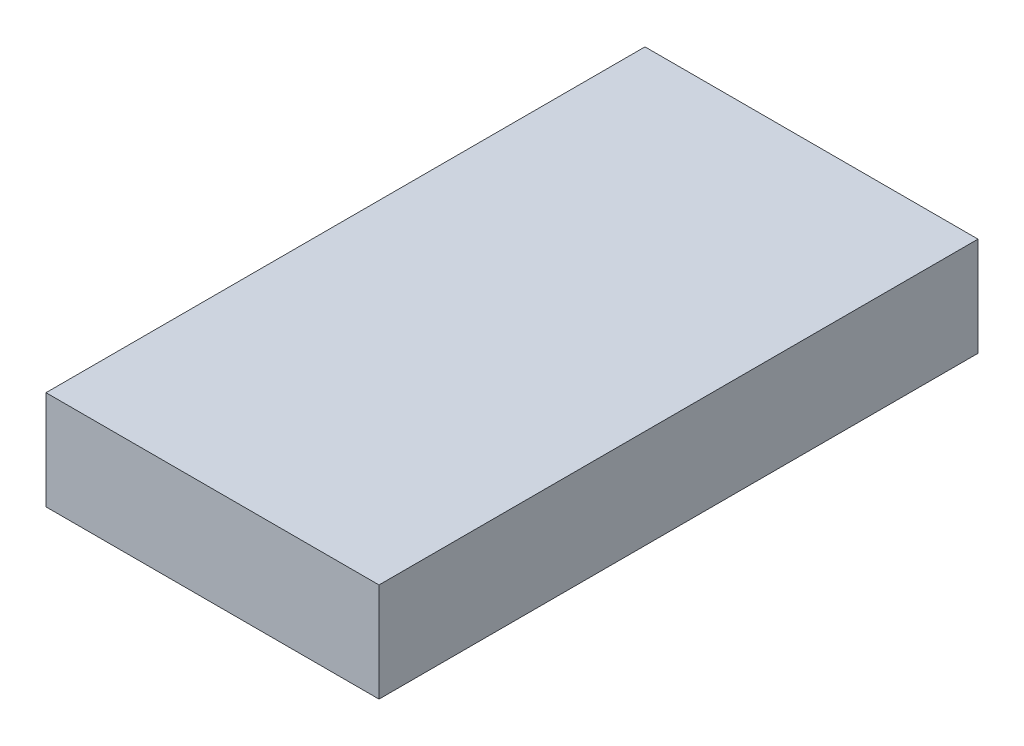
ISO-10303-21;
HEADER;
FILE_DESCRIPTION(('STEP AP214'),'2;1');
FILE_NAME('part.step','',(''),(''),'','','');
FILE_SCHEMA(('AUTOMOTIVE_DESIGN { 1 0 10303 214 1 1 1 1 }'));
ENDSEC;
DATA;
#1=APPLICATION_CONTEXT('core data for automotive mechanical design processes');
#2=APPLICATION_PROTOCOL_DEFINITION('international standard','automotive_design',2000,#1);
#3=PRODUCT_CONTEXT('',#1,'mechanical');
#4=PRODUCT('Part','Part','',(#3));
#5=PRODUCT_RELATED_PRODUCT_CATEGORY('part','',(#4));
#6=PRODUCT_DEFINITION_FORMATION('','',#4);
#7=PRODUCT_DEFINITION_CONTEXT('part definition',#1,'design');
#8=PRODUCT_DEFINITION('design','',#6,#7);
#9=PRODUCT_DEFINITION_SHAPE('','',#8);
#10=(LENGTH_UNIT() NAMED_UNIT(*) SI_UNIT(.MILLI.,.METRE.));
#11=(NAMED_UNIT(*) PLANE_ANGLE_UNIT() SI_UNIT($,.RADIAN.));
#12=(NAMED_UNIT(*) SI_UNIT($,.STERADIAN.) SOLID_ANGLE_UNIT());
#13=UNCERTAINTY_MEASURE_WITH_UNIT(LENGTH_MEASURE(1.E-05),#10,'distance_accuracy_value','');
#14=(GEOMETRIC_REPRESENTATION_CONTEXT(3) GLOBAL_UNCERTAINTY_ASSIGNED_CONTEXT((#13)) GLOBAL_UNIT_ASSIGNED_CONTEXT((#10,
#11,#12)) REPRESENTATION_CONTEXT('',''));
#15=CARTESIAN_POINT('',(0.,0.,0.));
#16=DIRECTION('',(0.,0.,1.));
#17=DIRECTION('',(1.,0.,0.));
#18=AXIS2_PLACEMENT_3D('',#15,#16,#17);
#19=CARTESIAN_POINT('',(0.,0.,0.));
#20=DIRECTION('',(0.,-1.,0.));
#21=DIRECTION('',(0.,0.,-1.));
#22=AXIS2_PLACEMENT_3D('',#19,#20,#21);
#23=PLANE('',#22);
#24=DIRECTION('',(1.,0.,0.));
#25=VECTOR('',#24,1.);
#26=CARTESIAN_POINT('',(25.3849687622807,0.,-25.1890079802592));
#27=LINE('',#26,#25);
#28=CARTESIAN_POINT('',(0.684968762280747,0.,-25.1890079802592));
#29=VERTEX_POINT('',#28);
#30=CARTESIAN_POINT('',(2.75540040668321,0.,-25.1890079802592));
#31=VERTEX_POINT('',#30);
#32=EDGE_CURVE('E55',#29,#31,#27,.T.);
#33=ORIENTED_EDGE('',*,*,#32,.F.);
#34=DIRECTION('',(0.,0.,-1.));
#35=VECTOR('',#34,1.);
#36=CARTESIAN_POINT('',(0.684968762280747,0.,0.0281061356304235));
#37=LINE('',#36,#35);
#38=CARTESIAN_POINT('',(0.684968762280747,0.,0.));
#39=VERTEX_POINT('',#38);
#40=EDGE_CURVE('E250',#39,#29,#37,.T.);
#41=ORIENTED_EDGE('',*,*,#40,.F.);
#42=DIRECTION('',(1.,0.,0.));
#43=VECTOR('',#42,1.);
#44=CARTESIAN_POINT('',(0.,0.,0.));
#45=LINE('',#44,#43);
#46=CARTESIAN_POINT('',(0.,0.,0.));
#47=VERTEX_POINT('',#46);
#48=EDGE_CURVE('E456',#47,#39,#45,.T.);
#49=ORIENTED_EDGE('',*,*,#48,.F.);
#50=DIRECTION('',(0.,0.,1.));
#51=VECTOR('',#50,1.);
#52=CARTESIAN_POINT('',(0.,0.,0.));
#53=LINE('',#52,#51);
#54=CARTESIAN_POINT('',(0.,0.,-46.));
#55=VERTEX_POINT('',#54);
#56=EDGE_CURVE('E430',#55,#47,#53,.T.);
#57=ORIENTED_EDGE('',*,*,#56,.F.);
#58=DIRECTION('',(-1.,0.,0.));
#59=VECTOR('',#58,1.);
#60=CARTESIAN_POINT('',(0.,0.,-46.));
#61=LINE('',#60,#59);
#62=CARTESIAN_POINT('',(2.75540040668321,0.,-46.));
#63=VERTEX_POINT('',#62);
#64=EDGE_CURVE('E463',#63,#55,#61,.T.);
#65=ORIENTED_EDGE('',*,*,#64,.F.);
#66=DIRECTION('',(0.,0.,-1.));
#67=VECTOR('',#66,1.);
#68=CARTESIAN_POINT('',(2.75540040668321,0.,0.));
#69=LINE('',#68,#67);
#70=EDGE_CURVE('E275',#31,#63,#69,.T.);
#71=ORIENTED_EDGE('',*,*,#70,.F.);
#72=EDGE_LOOP('',(#33,#41,#49,#57,#65,#71));
#73=FACE_BOUND('',#72,.T.);
#74=ADVANCED_FACE('F39',(#73),#23,.T.);
#75=CARTESIAN_POINT('',(0.,0.399999999999999,0.));
#76=DIRECTION('',(0.,1.,0.));
#77=DIRECTION('',(0.,0.,1.));
#78=AXIS2_PLACEMENT_3D('',#75,#76,#77);
#79=PLANE('',#78);
#80=DIRECTION('',(-1.,0.,0.));
#81=VECTOR('',#80,1.);
#82=CARTESIAN_POINT('',(0.,0.399999999999999,-25.1890079802592));
#83=LINE('',#82,#81);
#84=CARTESIAN_POINT('',(2.75540040668321,0.399999999999999,-25.1890079802592));
#85=VERTEX_POINT('',#84);
#86=CARTESIAN_POINT('',(0.684968762280747,0.399999999999999,-25.1890079802592));
#87=VERTEX_POINT('',#86);
#88=EDGE_CURVE('E264',#85,#87,#83,.T.);
#89=ORIENTED_EDGE('',*,*,#88,.F.);
#90=DIRECTION('',(0.,0.,1.));
#91=VECTOR('',#90,1.);
#92=CARTESIAN_POINT('',(2.75540040668321,0.399999999999999,0.));
#93=LINE('',#92,#91);
#94=CARTESIAN_POINT('',(2.75540040668321,0.399999999999999,-44.5));
#95=VERTEX_POINT('',#94);
#96=EDGE_CURVE('E310',#95,#85,#93,.T.);
#97=ORIENTED_EDGE('',*,*,#96,.F.);
#98=DIRECTION('',(-1.,0.,0.));
#99=VECTOR('',#98,1.);
#100=CARTESIAN_POINT('',(0.65,0.399999999999999,-44.5));
#101=LINE('',#100,#99);
#102=CARTESIAN_POINT('',(0.65,0.399999999999999,-44.5));
#103=VERTEX_POINT('',#102);
#104=EDGE_CURVE('E412',#95,#103,#101,.T.);
#105=ORIENTED_EDGE('',*,*,#104,.T.);
#106=DIRECTION('',(0.,0.,1.));
#107=VECTOR('',#106,1.);
#108=CARTESIAN_POINT('',(0.65,0.399999999999999,-44.5));
#109=LINE('',#108,#107);
#110=CARTESIAN_POINT('',(0.650000000000005,0.399999999999999,0.));
#111=VERTEX_POINT('',#110);
#112=EDGE_CURVE('E404',#103,#111,#109,.T.);
#113=ORIENTED_EDGE('',*,*,#112,.T.);
#114=DIRECTION('',(1.,0.,0.));
#115=VECTOR('',#114,1.);
#116=CARTESIAN_POINT('',(0.,0.399999999999999,0.));
#117=LINE('',#116,#115);
#118=CARTESIAN_POINT('',(0.684968762280747,0.399999999999999,0.));
#119=VERTEX_POINT('',#118);
#120=EDGE_CURVE('E494',#111,#119,#117,.T.);
#121=ORIENTED_EDGE('',*,*,#120,.T.);
#122=DIRECTION('',(0.,0.,1.));
#123=VECTOR('',#122,1.);
#124=CARTESIAN_POINT('',(0.684968762280747,0.399999999999999,0.));
#125=LINE('',#124,#123);
#126=EDGE_CURVE('E272',#87,#119,#125,.T.);
#127=ORIENTED_EDGE('',*,*,#126,.F.);
#128=EDGE_LOOP('',(#89,#97,#105,#113,#121,#127));
#129=FACE_BOUND('',#128,.T.);
#130=ADVANCED_FACE('F548',(#129),#79,.T.);
#131=CARTESIAN_POINT('',(0.,5.8,0.));
#132=DIRECTION('',(0.,-1.,0.));
#133=DIRECTION('',(0.,0.,-1.));
#134=AXIS2_PLACEMENT_3D('',#131,#132,#133);
#135=PLANE('',#134);
#136=DIRECTION('',(-1.,0.,0.));
#137=VECTOR('',#136,1.);
#138=CARTESIAN_POINT('',(0.,5.8,-46.));
#139=LINE('',#138,#137);
#140=CARTESIAN_POINT('',(26.,5.8,-46.));
#141=VERTEX_POINT('',#140);
#142=CARTESIAN_POINT('',(0.,5.8,-46.));
#143=VERTEX_POINT('',#142);
#144=EDGE_CURVE('E447',#141,#143,#139,.T.);
#145=ORIENTED_EDGE('',*,*,#144,.T.);
#146=DIRECTION('',(0.,0.,1.));
#147=VECTOR('',#146,1.);
#148=CARTESIAN_POINT('',(0.,5.8,0.));
#149=LINE('',#148,#147);
#150=CARTESIAN_POINT('',(0.,5.8,0.));
#151=VERTEX_POINT('',#150);
#152=EDGE_CURVE('E434',#143,#151,#149,.T.);
#153=ORIENTED_EDGE('',*,*,#152,.T.);
#154=DIRECTION('',(1.,0.,0.));
#155=VECTOR('',#154,1.);
#156=CARTESIAN_POINT('',(0.,5.8,0.));
#157=LINE('',#156,#155);
#158=CARTESIAN_POINT('',(26.,5.8,0.));
#159=VERTEX_POINT('',#158);
#160=EDGE_CURVE('E438',#151,#159,#157,.T.);
#161=ORIENTED_EDGE('',*,*,#160,.T.);
#162=DIRECTION('',(0.,0.,-1.));
#163=VECTOR('',#162,1.);
#164=CARTESIAN_POINT('',(26.,5.8,0.));
#165=LINE('',#164,#163);
#166=EDGE_CURVE('E443',#159,#141,#165,.T.);
#167=ORIENTED_EDGE('',*,*,#166,.T.);
#168=EDGE_LOOP('',(#145,#153,#161,#167));
#169=FACE_BOUND('',#168,.T.);
#170=DIRECTION('',(0.,0.,-1.));
#171=VECTOR('',#170,1.);
#172=CARTESIAN_POINT('',(-1.29110395612455,5.8,6.10680898532167));
#173=LINE('',#172,#171);
#174=CARTESIAN_POINT('',(-1.29110395612455,5.8,5.10680898532167));
#175=VERTEX_POINT('',#174);
#176=CARTESIAN_POINT('',(-1.29110395612455,5.8,-47.3931910146783));
#177=VERTEX_POINT('',#176);
#178=EDGE_CURVE('E358',#175,#177,#173,.T.);
#179=ORIENTED_EDGE('',*,*,#178,.T.);
#180=DIRECTION('',(-1.,0.,0.));
#181=VECTOR('',#180,1.);
#182=CARTESIAN_POINT('',(27.0088960438754,5.8,-47.3931910146783));
#183=LINE('',#182,#181);
#184=CARTESIAN_POINT('',(27.0088960438754,5.8,-47.3931910146783));
#185=VERTEX_POINT('',#184);
#186=EDGE_CURVE('E318',#185,#177,#183,.T.);
#187=ORIENTED_EDGE('',*,*,#186,.F.);
#188=DIRECTION('',(0.,0.,-1.));
#189=VECTOR('',#188,1.);
#190=CARTESIAN_POINT('',(27.0088960438754,5.8,5.10680898532167));
#191=LINE('',#190,#189);
#192=CARTESIAN_POINT('',(27.0088960438754,5.8,5.10680898532167));
#193=VERTEX_POINT('',#192);
#194=EDGE_CURVE('E331',#193,#185,#191,.T.);
#195=ORIENTED_EDGE('',*,*,#194,.F.);
#196=DIRECTION('',(1.,0.,0.));
#197=VECTOR('',#196,1.);
#198=CARTESIAN_POINT('',(-1.29110395612455,5.8,5.10680898532167));
#199=LINE('',#198,#197);
#200=EDGE_CURVE('E342',#175,#193,#199,.T.);
#201=ORIENTED_EDGE('',*,*,#200,.F.);
#202=EDGE_LOOP('',(#179,#187,#195,#201));
#203=FACE_BOUND('',#202,.T.);
#204=ADVANCED_FACE('F559',(#169,#203),#135,.T.);
#205=CARTESIAN_POINT('',(-1.29110395612455,-2.2,6.10680898532167));
#206=DIRECTION('',(1.,0.,0.));
#207=DIRECTION('',(0.,0.,-1.));
#208=AXIS2_PLACEMENT_3D('',#205,#206,#207);
#209=PLANE('',#208);
#210=DIRECTION('',(0.,0.,-1.));
#211=VECTOR('',#210,1.);
#212=CARTESIAN_POINT('',(-1.29110395612455,-2.2,6.10680898532167));
#213=LINE('',#212,#211);
#214=CARTESIAN_POINT('',(-1.29110395612455,-2.2,5.10680898532167));
#215=VERTEX_POINT('',#214);
#216=CARTESIAN_POINT('',(-1.29110395612455,-2.2,-47.3931910146783));
#217=VERTEX_POINT('',#216);
#218=EDGE_CURVE('E363',#215,#217,#213,.T.);
#219=ORIENTED_EDGE('',*,*,#218,.T.);
#220=DIRECTION('',(0.,1.,0.));
#221=VECTOR('',#220,1.);
#222=CARTESIAN_POINT('',(-1.29110395612455,-2.2,-47.3931910146783));
#223=LINE('',#222,#221);
#224=EDGE_CURVE('E322',#217,#177,#223,.T.);
#225=ORIENTED_EDGE('',*,*,#224,.T.);
#226=ORIENTED_EDGE('',*,*,#178,.F.);
#227=DIRECTION('',(0.,1.,0.));
#228=VECTOR('',#227,1.);
#229=CARTESIAN_POINT('',(-1.29110395612455,-2.2,5.10680898532167));
#230=LINE('',#229,#228);
#231=EDGE_CURVE('E351',#215,#175,#230,.T.);
#232=ORIENTED_EDGE('',*,*,#231,.F.);
#233=EDGE_LOOP('',(#219,#225,#226,#232));
#234=FACE_BOUND('',#233,.T.);
#235=ADVANCED_FACE('F590',(#234),#209,.T.);
#236=CARTESIAN_POINT('',(27.0088960438754,-2.2,5.10680898532167));
#237=DIRECTION('',(1.,0.,0.));
#238=DIRECTION('',(0.,0.,-1.));
#239=AXIS2_PLACEMENT_3D('',#236,#237,#238);
#240=PLANE('',#239);
#241=DIRECTION('',(0.,1.,0.));
#242=VECTOR('',#241,1.);
#243=CARTESIAN_POINT('',(27.0088960438754,-2.2,-47.3931910146783));
#244=LINE('',#243,#242);
#245=CARTESIAN_POINT('',(27.0088960438754,-2.2,-47.3931910146783));
#246=VERTEX_POINT('',#245);
#247=EDGE_CURVE('E328',#246,#185,#244,.T.);
#248=ORIENTED_EDGE('',*,*,#247,.F.);
#249=DIRECTION('',(0.,0.,-1.));
#250=VECTOR('',#249,1.);
#251=CARTESIAN_POINT('',(27.0088960438754,-2.2,5.10680898532167));
#252=LINE('',#251,#250);
#253=CARTESIAN_POINT('',(27.0088960438754,-2.2,5.10680898532167));
#254=VERTEX_POINT('',#253);
#255=EDGE_CURVE('E332',#254,#246,#252,.T.);
#256=ORIENTED_EDGE('',*,*,#255,.F.);
#257=DIRECTION('',(0.,1.,0.));
#258=VECTOR('',#257,1.);
#259=CARTESIAN_POINT('',(27.0088960438754,-2.2,5.10680898532167));
#260=LINE('',#259,#258);
#261=EDGE_CURVE('E336',#254,#193,#260,.T.);
#262=ORIENTED_EDGE('',*,*,#261,.T.);
#263=ORIENTED_EDGE('',*,*,#194,.T.);
#264=EDGE_LOOP('',(#248,#256,#262,#263));
#265=FACE_BOUND('',#264,.T.);
#266=ADVANCED_FACE('F632',(#265),#240,.F.);
#267=CARTESIAN_POINT('',(-1.29110395612455,-2.2,5.10680898532167));
#268=DIRECTION('',(0.,0.,1.));
#269=DIRECTION('',(1.,0.,0.));
#270=AXIS2_PLACEMENT_3D('',#267,#268,#269);
#271=PLANE('',#270);
#272=ORIENTED_EDGE('',*,*,#261,.F.);
#273=DIRECTION('',(1.,0.,0.));
#274=VECTOR('',#273,1.);
#275=CARTESIAN_POINT('',(-1.29110395612455,-2.2,5.10680898532167));
#276=LINE('',#275,#274);
#277=EDGE_CURVE('E343',#215,#254,#276,.T.);
#278=ORIENTED_EDGE('',*,*,#277,.F.);
#279=ORIENTED_EDGE('',*,*,#231,.T.);
#280=ORIENTED_EDGE('',*,*,#200,.T.);
#281=EDGE_LOOP('',(#272,#278,#279,#280));
#282=FACE_BOUND('',#281,.T.);
#283=ADVANCED_FACE('F638',(#282),#271,.F.);
#284=CARTESIAN_POINT('',(0.,5.8,0.));
#285=DIRECTION('',(0.,0.,-1.));
#286=DIRECTION('',(-1.,0.,0.));
#287=AXIS2_PLACEMENT_3D('',#284,#285,#286);
#288=PLANE('',#287);
#289=ORIENTED_EDGE('',*,*,#48,.T.);
#290=DIRECTION('',(0.,1.,0.));
#291=VECTOR('',#290,1.);
#292=CARTESIAN_POINT('',(0.684968762280747,5.8,0.));
#293=LINE('',#292,#291);
#294=EDGE_CURVE('E12',#39,#119,#293,.T.);
#295=ORIENTED_EDGE('',*,*,#294,.T.);
#296=ORIENTED_EDGE('',*,*,#120,.F.);
#297=DIRECTION('',(0.,1.,0.));
#298=VECTOR('',#297,1.);
#299=CARTESIAN_POINT('',(0.650000000000005,5.8,0.));
#300=LINE('',#299,#298);
#301=CARTESIAN_POINT('',(0.650000000000005,5.4,0.));
#302=VERTEX_POINT('',#301);
#303=EDGE_CURVE('E490',#111,#302,#300,.T.);
#304=ORIENTED_EDGE('',*,*,#303,.T.);
#305=DIRECTION('',(1.,0.,0.));
#306=VECTOR('',#305,1.);
#307=CARTESIAN_POINT('',(0.,5.4,0.));
#308=LINE('',#307,#306);
#309=CARTESIAN_POINT('',(25.35,5.4,0.));
#310=VERTEX_POINT('',#309);
#311=EDGE_CURVE('E482',#302,#310,#308,.T.);
#312=ORIENTED_EDGE('',*,*,#311,.T.);
#313=DIRECTION('',(0.,-1.,0.));
#314=VECTOR('',#313,1.);
#315=CARTESIAN_POINT('',(25.35,5.8,0.));
#316=LINE('',#315,#314);
#317=CARTESIAN_POINT('',(25.35,1.,0.));
#318=VERTEX_POINT('',#317);
#319=EDGE_CURVE('E486',#310,#318,#316,.T.);
#320=ORIENTED_EDGE('',*,*,#319,.T.);
#321=DIRECTION('',(1.,0.,0.));
#322=VECTOR('',#321,1.);
#323=CARTESIAN_POINT('',(0.,1.,0.));
#324=LINE('',#323,#322);
#325=CARTESIAN_POINT('',(25.3849687622807,1.,0.));
#326=VERTEX_POINT('',#325);
#327=EDGE_CURVE('E267',#318,#326,#324,.T.);
#328=ORIENTED_EDGE('',*,*,#327,.T.);
#329=DIRECTION('',(0.,-1.,0.));
#330=VECTOR('',#329,1.);
#331=CARTESIAN_POINT('',(25.3849687622807,5.8,0.));
#332=LINE('',#331,#330);
#333=CARTESIAN_POINT('',(25.3849687622807,0.,0.));
#334=VERTEX_POINT('',#333);
#335=EDGE_CURVE('E241',#326,#334,#332,.T.);
#336=ORIENTED_EDGE('',*,*,#335,.T.);
#337=CARTESIAN_POINT('',(26.,0.,0.));
#338=VERTEX_POINT('',#337);
#339=EDGE_CURVE('E455',#334,#338,#45,.T.);
#340=ORIENTED_EDGE('',*,*,#339,.T.);
#341=DIRECTION('',(0.,-1.,0.));
#342=VECTOR('',#341,1.);
#343=CARTESIAN_POINT('',(26.,5.8,0.));
#344=LINE('',#343,#342);
#345=EDGE_CURVE('E474',#159,#338,#344,.T.);
#346=ORIENTED_EDGE('',*,*,#345,.F.);
#347=ORIENTED_EDGE('',*,*,#160,.F.);
#348=DIRECTION('',(0.,-1.,0.));
#349=VECTOR('',#348,1.);
#350=CARTESIAN_POINT('',(0.,5.8,0.));
#351=LINE('',#350,#349);
#352=EDGE_CURVE('E478',#151,#47,#351,.T.);
#353=ORIENTED_EDGE('',*,*,#352,.T.);
#354=EDGE_LOOP('',(#289,#295,#296,#304,#312,#320,#328,#336,#340,#346,#347,#353));
#355=FACE_BOUND('',#354,.T.);
#356=ADVANCED_FACE('F506',(#355),#288,.F.);
#357=CARTESIAN_POINT('',(0.,5.8,0.));
#358=DIRECTION('',(1.,0.,0.));
#359=DIRECTION('',(0.,0.,-1.));
#360=AXIS2_PLACEMENT_3D('',#357,#358,#359);
#361=PLANE('',#360);
#362=ORIENTED_EDGE('',*,*,#56,.T.);
#363=ORIENTED_EDGE('',*,*,#352,.F.);
#364=ORIENTED_EDGE('',*,*,#152,.F.);
#365=DIRECTION('',(0.,-1.,0.));
#366=VECTOR('',#365,1.);
#367=CARTESIAN_POINT('',(0.,5.8,-46.));
#368=LINE('',#367,#366);
#369=EDGE_CURVE('E451',#143,#55,#368,.T.);
#370=ORIENTED_EDGE('',*,*,#369,.T.);
#371=EDGE_LOOP('',(#362,#363,#364,#370));
#372=FACE_BOUND('',#371,.T.);
#373=ADVANCED_FACE('F41',(#372),#361,.F.);
#374=CARTESIAN_POINT('',(26.,5.8,0.));
#375=DIRECTION('',(-1.,0.,0.));
#376=DIRECTION('',(0.,0.,1.));
#377=AXIS2_PLACEMENT_3D('',#374,#375,#376);
#378=PLANE('',#377);
#379=DIRECTION('',(0.,0.,-1.));
#380=VECTOR('',#379,1.);
#381=CARTESIAN_POINT('',(26.,0.,0.));
#382=LINE('',#381,#380);
#383=CARTESIAN_POINT('',(26.,0.,-46.));
#384=VERTEX_POINT('',#383);
#385=EDGE_CURVE('E460',#338,#384,#382,.T.);
#386=ORIENTED_EDGE('',*,*,#385,.T.);
#387=DIRECTION('',(0.,-1.,0.));
#388=VECTOR('',#387,1.);
#389=CARTESIAN_POINT('',(26.,5.8,-46.));
#390=LINE('',#389,#388);
#391=EDGE_CURVE('E470',#141,#384,#390,.T.);
#392=ORIENTED_EDGE('',*,*,#391,.F.);
#393=ORIENTED_EDGE('',*,*,#166,.F.);
#394=ORIENTED_EDGE('',*,*,#345,.T.);
#395=EDGE_LOOP('',(#386,#392,#393,#394));
#396=FACE_BOUND('',#395,.T.);
#397=ADVANCED_FACE('F563',(#396),#378,.F.);
#398=CARTESIAN_POINT('',(0.,5.8,-46.));
#399=DIRECTION('',(0.,0.,1.));
#400=DIRECTION('',(1.,0.,0.));
#401=AXIS2_PLACEMENT_3D('',#398,#399,#400);
#402=PLANE('',#401);
#403=DIRECTION('',(1.,0.,0.));
#404=VECTOR('',#403,1.);
#405=CARTESIAN_POINT('',(0.,2.,-46.));
#406=LINE('',#405,#404);
#407=CARTESIAN_POINT('',(2.75540040668321,2.,-46.));
#408=VERTEX_POINT('',#407);
#409=CARTESIAN_POINT('',(22.5963229985607,2.,-46.));
#410=VERTEX_POINT('',#409);
#411=EDGE_CURVE('E292',#408,#410,#406,.T.);
#412=ORIENTED_EDGE('',*,*,#411,.F.);
#413=DIRECTION('',(0.,-1.,0.));
#414=VECTOR('',#413,1.);
#415=CARTESIAN_POINT('',(2.75540040668321,5.8,-46.));
#416=LINE('',#415,#414);
#417=EDGE_CURVE('E314',#408,#63,#416,.T.);
#418=ORIENTED_EDGE('',*,*,#417,.T.);
#419=ORIENTED_EDGE('',*,*,#64,.T.);
#420=ORIENTED_EDGE('',*,*,#369,.F.);
#421=ORIENTED_EDGE('',*,*,#144,.F.);
#422=ORIENTED_EDGE('',*,*,#391,.T.);
#423=CARTESIAN_POINT('',(22.5963229985607,0.,-46.));
#424=VERTEX_POINT('',#423);
#425=EDGE_CURVE('E439',#384,#424,#61,.T.);
#426=ORIENTED_EDGE('',*,*,#425,.T.);
#427=DIRECTION('',(0.,1.,0.));
#428=VECTOR('',#427,1.);
#429=CARTESIAN_POINT('',(22.5963229985607,5.8,-46.));
#430=LINE('',#429,#428);
#431=EDGE_CURVE('E302',#424,#410,#430,.T.);
#432=ORIENTED_EDGE('',*,*,#431,.T.);
#433=EDGE_LOOP('',(#412,#418,#419,#420,#421,#422,#426,#432));
#434=FACE_BOUND('',#433,.T.);
#435=ADVANCED_FACE('F539',(#434),#402,.F.);
#436=DIRECTION('',(0.,0.,1.));
#437=VECTOR('',#436,1.);
#438=CARTESIAN_POINT('',(25.3849687622807,0.,0.0281061356304235));
#439=LINE('',#438,#437);
#440=CARTESIAN_POINT('',(25.3849687622807,0.,-25.1890079802592));
#441=VERTEX_POINT('',#440);
#442=EDGE_CURVE('E247',#441,#334,#439,.T.);
#443=ORIENTED_EDGE('',*,*,#442,.F.);
#444=CARTESIAN_POINT('',(22.5963229985607,0.,-25.1890079802592));
#445=VERTEX_POINT('',#444);
#446=EDGE_CURVE('E234',#445,#441,#27,.T.);
#447=ORIENTED_EDGE('',*,*,#446,.F.);
#448=DIRECTION('',(0.,0.,1.));
#449=VECTOR('',#448,1.);
#450=CARTESIAN_POINT('',(22.5963229985607,0.,0.));
#451=LINE('',#450,#449);
#452=EDGE_CURVE('E281',#424,#445,#451,.T.);
#453=ORIENTED_EDGE('',*,*,#452,.F.);
#454=ORIENTED_EDGE('',*,*,#425,.F.);
#455=ORIENTED_EDGE('',*,*,#385,.F.);
#456=ORIENTED_EDGE('',*,*,#339,.F.);
#457=EDGE_LOOP('',(#443,#447,#453,#454,#455,#456));
#458=FACE_BOUND('',#457,.T.);
#459=ADVANCED_FACE('F568',(#458),#23,.T.);
#460=CARTESIAN_POINT('',(0.65,0.399999999999999,-44.5));
#461=DIRECTION('',(-1.,0.,0.));
#462=DIRECTION('',(0.,0.,1.));
#463=AXIS2_PLACEMENT_3D('',#460,#461,#462);
#464=PLANE('',#463);
#465=ORIENTED_EDGE('',*,*,#112,.F.);
#466=DIRECTION('',(0.,1.,0.));
#467=VECTOR('',#466,1.);
#468=CARTESIAN_POINT('',(0.65,0.399999999999999,-44.5));
#469=LINE('',#468,#467);
#470=CARTESIAN_POINT('',(0.65,5.4,-44.5));
#471=VERTEX_POINT('',#470);
#472=EDGE_CURVE('E427',#103,#471,#469,.T.);
#473=ORIENTED_EDGE('',*,*,#472,.T.);
#474=DIRECTION('',(0.,0.,1.));
#475=VECTOR('',#474,1.);
#476=CARTESIAN_POINT('',(0.65,5.4,-44.5));
#477=LINE('',#476,#475);
#478=EDGE_CURVE('E403',#471,#302,#477,.T.);
#479=ORIENTED_EDGE('',*,*,#478,.T.);
#480=ORIENTED_EDGE('',*,*,#303,.F.);
#481=EDGE_LOOP('',(#465,#473,#479,#480));
#482=FACE_BOUND('',#481,.T.);
#483=ADVANCED_FACE('F514',(#482),#464,.F.);
#484=CARTESIAN_POINT('',(25.35,0.399999999999999,-44.5));
#485=DIRECTION('',(1.,0.,0.));
#486=DIRECTION('',(0.,0.,-1.));
#487=AXIS2_PLACEMENT_3D('',#484,#485,#486);
#488=PLANE('',#487);
#489=DIRECTION('',(0.,0.,-1.));
#490=VECTOR('',#489,1.);
#491=CARTESIAN_POINT('',(25.35,0.399999999999999,-44.5));
#492=LINE('',#491,#490);
#493=CARTESIAN_POINT('',(25.35,0.399999999999999,-25.1890079802592));
#494=VERTEX_POINT('',#493);
#495=CARTESIAN_POINT('',(25.35,0.399999999999999,-44.5));
#496=VERTEX_POINT('',#495);
#497=EDGE_CURVE('E408',#494,#496,#492,.T.);
#498=ORIENTED_EDGE('',*,*,#497,.F.);
#499=DIRECTION('',(0.,1.,0.));
#500=VECTOR('',#499,1.);
#501=CARTESIAN_POINT('',(25.35,0.399999999999999,-25.1890079802592));
#502=LINE('',#501,#500);
#503=CARTESIAN_POINT('',(25.35,1.,-25.1890079802592));
#504=VERTEX_POINT('',#503);
#505=EDGE_CURVE('E258',#494,#504,#502,.T.);
#506=ORIENTED_EDGE('',*,*,#505,.T.);
#507=DIRECTION('',(0.,0.,1.));
#508=VECTOR('',#507,1.);
#509=CARTESIAN_POINT('',(25.35,1.,-44.5));
#510=LINE('',#509,#508);
#511=EDGE_CURVE('E48',#504,#318,#510,.T.);
#512=ORIENTED_EDGE('',*,*,#511,.T.);
#513=ORIENTED_EDGE('',*,*,#319,.F.);
#514=DIRECTION('',(0.,0.,-1.));
#515=VECTOR('',#514,1.);
#516=CARTESIAN_POINT('',(25.35,5.4,-44.5));
#517=LINE('',#516,#515);
#518=CARTESIAN_POINT('',(25.35,5.4,-44.5));
#519=VERTEX_POINT('',#518);
#520=EDGE_CURVE('E421',#310,#519,#517,.T.);
#521=ORIENTED_EDGE('',*,*,#520,.T.);
#522=DIRECTION('',(0.,1.,0.));
#523=VECTOR('',#522,1.);
#524=CARTESIAN_POINT('',(25.35,0.399999999999999,-44.5));
#525=LINE('',#524,#523);
#526=EDGE_CURVE('E417',#496,#519,#525,.T.);
#527=ORIENTED_EDGE('',*,*,#526,.F.);
#528=EDGE_LOOP('',(#498,#506,#512,#513,#521,#527));
#529=FACE_BOUND('',#528,.T.);
#530=ADVANCED_FACE('F504',(#529),#488,.F.);
#531=DIRECTION('',(-1.,0.,0.));
#532=VECTOR('',#531,1.);
#533=CARTESIAN_POINT('',(0.,0.399999999999999,-25.1890079802592));
#534=LINE('',#533,#532);
#535=CARTESIAN_POINT('',(22.5963229985607,0.399999999999999,-25.1890079802592));
#536=VERTEX_POINT('',#535);
#537=EDGE_CURVE('E63',#494,#536,#534,.T.);
#538=ORIENTED_EDGE('',*,*,#537,.F.);
#539=ORIENTED_EDGE('',*,*,#497,.T.);
#540=CARTESIAN_POINT('',(22.5963229985607,0.399999999999999,-44.5));
#541=VERTEX_POINT('',#540);
#542=EDGE_CURVE('E413',#496,#541,#101,.T.);
#543=ORIENTED_EDGE('',*,*,#542,.T.);
#544=DIRECTION('',(0.,0.,-1.));
#545=VECTOR('',#544,1.);
#546=CARTESIAN_POINT('',(22.5963229985607,0.399999999999999,0.));
#547=LINE('',#546,#545);
#548=EDGE_CURVE('E299',#536,#541,#547,.T.);
#549=ORIENTED_EDGE('',*,*,#548,.F.);
#550=EDGE_LOOP('',(#538,#539,#543,#549));
#551=FACE_BOUND('',#550,.T.);
#552=ADVANCED_FACE('F522',(#551),#79,.T.);
#553=CARTESIAN_POINT('',(0.,5.4,0.));
#554=DIRECTION('',(0.,1.,0.));
#555=DIRECTION('',(0.,0.,1.));
#556=AXIS2_PLACEMENT_3D('',#553,#554,#555);
#557=PLANE('',#556);
#558=ORIENTED_EDGE('',*,*,#478,.F.);
#559=DIRECTION('',(-1.,0.,0.));
#560=VECTOR('',#559,1.);
#561=CARTESIAN_POINT('',(0.65,5.4,-44.5));
#562=LINE('',#561,#560);
#563=EDGE_CURVE('E409',#519,#471,#562,.T.);
#564=ORIENTED_EDGE('',*,*,#563,.F.);
#565=ORIENTED_EDGE('',*,*,#520,.F.);
#566=ORIENTED_EDGE('',*,*,#311,.F.);
#567=EDGE_LOOP('',(#558,#564,#565,#566));
#568=FACE_BOUND('',#567,.T.);
#569=ADVANCED_FACE('F510',(#568),#557,.F.);
#570=CARTESIAN_POINT('',(0.65,0.399999999999999,-44.5));
#571=DIRECTION('',(0.,0.,-1.));
#572=DIRECTION('',(-1.,0.,0.));
#573=AXIS2_PLACEMENT_3D('',#570,#571,#572);
#574=PLANE('',#573);
#575=ORIENTED_EDGE('',*,*,#104,.F.);
#576=DIRECTION('',(0.,1.,0.));
#577=VECTOR('',#576,1.);
#578=CARTESIAN_POINT('',(2.75540040668321,0.399999999999999,-44.5));
#579=LINE('',#578,#577);
#580=CARTESIAN_POINT('',(2.75540040668321,2.,-44.5));
#581=VERTEX_POINT('',#580);
#582=EDGE_CURVE('E306',#95,#581,#579,.T.);
#583=ORIENTED_EDGE('',*,*,#582,.T.);
#584=DIRECTION('',(-1.,0.,0.));
#585=VECTOR('',#584,1.);
#586=CARTESIAN_POINT('',(0.65,2.,-44.5));
#587=LINE('',#586,#585);
#588=CARTESIAN_POINT('',(22.5963229985607,2.,-44.5));
#589=VERTEX_POINT('',#588);
#590=EDGE_CURVE('E284',#589,#581,#587,.T.);
#591=ORIENTED_EDGE('',*,*,#590,.F.);
#592=DIRECTION('',(0.,-1.,0.));
#593=VECTOR('',#592,1.);
#594=CARTESIAN_POINT('',(22.5963229985607,0.399999999999999,-44.5));
#595=LINE('',#594,#593);
#596=EDGE_CURVE('E295',#589,#541,#595,.T.);
#597=ORIENTED_EDGE('',*,*,#596,.T.);
#598=ORIENTED_EDGE('',*,*,#542,.F.);
#599=ORIENTED_EDGE('',*,*,#526,.T.);
#600=ORIENTED_EDGE('',*,*,#563,.T.);
#601=ORIENTED_EDGE('',*,*,#472,.F.);
#602=EDGE_LOOP('',(#575,#583,#591,#597,#598,#599,#600,#601));
#603=FACE_BOUND('',#602,.T.);
#604=ADVANCED_FACE('F518',(#603),#574,.F.);
#605=CARTESIAN_POINT('',(28.0088960438754,6.8,-48.3931910146783));
#606=DIRECTION('',(-1.,0.,0.));
#607=DIRECTION('',(0.,0.,1.));
#608=AXIS2_PLACEMENT_3D('',#605,#606,#607);
#609=PLANE('',#608);
#610=DIRECTION('',(0.,0.,1.));
#611=VECTOR('',#610,1.);
#612=CARTESIAN_POINT('',(28.0088960438754,-2.2,6.10680898532167));
#613=LINE('',#612,#611);
#614=CARTESIAN_POINT('',(28.0088960438755,-2.2,-48.3931910146783));
#615=VERTEX_POINT('',#614);
#616=CARTESIAN_POINT('',(28.0088960438754,-2.2,6.10680898532167));
#617=VERTEX_POINT('',#616);
#618=EDGE_CURVE('E347',#615,#617,#613,.T.);
#619=ORIENTED_EDGE('',*,*,#618,.F.);
#620=DIRECTION('',(0.,-1.,0.));
#621=VECTOR('',#620,1.);
#622=CARTESIAN_POINT('',(28.0088960438754,6.8,-48.3931910146783));
#623=LINE('',#622,#621);
#624=CARTESIAN_POINT('',(28.0088960438754,6.8,-48.3931910146783));
#625=VERTEX_POINT('',#624);
#626=EDGE_CURVE('E399',#625,#615,#623,.T.);
#627=ORIENTED_EDGE('',*,*,#626,.F.);
#628=DIRECTION('',(0.,0.,-1.));
#629=VECTOR('',#628,1.);
#630=CARTESIAN_POINT('',(28.0088960438754,6.8,-48.3931910146783));
#631=LINE('',#630,#629);
#632=CARTESIAN_POINT('',(28.0088960438754,6.8,6.10680898532167));
#633=VERTEX_POINT('',#632);
#634=EDGE_CURVE('E374',#633,#625,#631,.T.);
#635=ORIENTED_EDGE('',*,*,#634,.F.);
#636=DIRECTION('',(0.,-1.,0.));
#637=VECTOR('',#636,1.);
#638=CARTESIAN_POINT('',(28.0088960438754,6.8,6.10680898532167));
#639=LINE('',#638,#637);
#640=EDGE_CURVE('E390',#633,#617,#639,.T.);
#641=ORIENTED_EDGE('',*,*,#640,.T.);
#642=EDGE_LOOP('',(#619,#627,#635,#641));
#643=FACE_BOUND('',#642,.T.);
#644=ADVANCED_FACE('F604',(#643),#609,.F.);
#645=CARTESIAN_POINT('',(28.0088960438754,6.8,-48.3931910146783));
#646=DIRECTION('',(0.,0.,1.));
#647=DIRECTION('',(1.,0.,0.));
#648=AXIS2_PLACEMENT_3D('',#645,#646,#647);
#649=PLANE('',#648);
#650=ORIENTED_EDGE('',*,*,#626,.T.);
#651=DIRECTION('',(1.,0.,0.));
#652=VECTOR('',#651,1.);
#653=CARTESIAN_POINT('',(-2.29110395612455,-2.2,-48.3931910146783));
#654=LINE('',#653,#652);
#655=CARTESIAN_POINT('',(-2.29110395612455,-2.2,-48.3931910146783));
#656=VERTEX_POINT('',#655);
#657=EDGE_CURVE('E367',#656,#615,#654,.T.);
#658=ORIENTED_EDGE('',*,*,#657,.F.);
#659=DIRECTION('',(0.,-1.,0.));
#660=VECTOR('',#659,1.);
#661=CARTESIAN_POINT('',(-2.29110395612456,6.8,-48.3931910146783));
#662=LINE('',#661,#660);
#663=CARTESIAN_POINT('',(-2.29110395612456,6.8,-48.3931910146783));
#664=VERTEX_POINT('',#663);
#665=EDGE_CURVE('E396',#664,#656,#662,.T.);
#666=ORIENTED_EDGE('',*,*,#665,.F.);
#667=DIRECTION('',(-1.,0.,0.));
#668=VECTOR('',#667,1.);
#669=CARTESIAN_POINT('',(28.0088960438754,6.8,-48.3931910146783));
#670=LINE('',#669,#668);
#671=EDGE_CURVE('E381',#625,#664,#670,.T.);
#672=ORIENTED_EDGE('',*,*,#671,.F.);
#673=EDGE_LOOP('',(#650,#658,#666,#672));
#674=FACE_BOUND('',#673,.T.);
#675=ADVANCED_FACE('F608',(#674),#649,.F.);
#676=CARTESIAN_POINT('',(-2.29110395612456,6.8,-48.3931910146783));
#677=DIRECTION('',(1.,0.,0.));
#678=DIRECTION('',(0.,0.,-1.));
#679=AXIS2_PLACEMENT_3D('',#676,#677,#678);
#680=PLANE('',#679);
#681=ORIENTED_EDGE('',*,*,#665,.T.);
#682=DIRECTION('',(0.,0.,-1.));
#683=VECTOR('',#682,1.);
#684=CARTESIAN_POINT('',(-2.29110395612456,-2.2,6.10680898532167));
#685=LINE('',#684,#683);
#686=CARTESIAN_POINT('',(-2.29110395612456,-2.2,6.10680898532167));
#687=VERTEX_POINT('',#686);
#688=EDGE_CURVE('E370',#687,#656,#685,.T.);
#689=ORIENTED_EDGE('',*,*,#688,.F.);
#690=DIRECTION('',(0.,-1.,0.));
#691=VECTOR('',#690,1.);
#692=CARTESIAN_POINT('',(-2.29110395612456,6.8,6.10680898532167));
#693=LINE('',#692,#691);
#694=CARTESIAN_POINT('',(-2.29110395612456,6.8,6.10680898532167));
#695=VERTEX_POINT('',#694);
#696=EDGE_CURVE('E393',#695,#687,#693,.T.);
#697=ORIENTED_EDGE('',*,*,#696,.F.);
#698=DIRECTION('',(0.,0.,1.));
#699=VECTOR('',#698,1.);
#700=CARTESIAN_POINT('',(-2.29110395612456,6.8,-48.3931910146783));
#701=LINE('',#700,#699);
#702=EDGE_CURVE('E384',#664,#695,#701,.T.);
#703=ORIENTED_EDGE('',*,*,#702,.F.);
#704=EDGE_LOOP('',(#681,#689,#697,#703));
#705=FACE_BOUND('',#704,.T.);
#706=ADVANCED_FACE('F613',(#705),#680,.F.);
#707=CARTESIAN_POINT('',(28.0088960438754,6.8,6.10680898532167));
#708=DIRECTION('',(0.,0.,-1.));
#709=DIRECTION('',(-1.,0.,0.));
#710=AXIS2_PLACEMENT_3D('',#707,#708,#709);
#711=PLANE('',#710);
#712=DIRECTION('',(1.,0.,0.));
#713=VECTOR('',#712,1.);
#714=CARTESIAN_POINT('',(-2.29110395612456,-2.2,6.10680898532167));
#715=LINE('',#714,#713);
#716=EDGE_CURVE('E359',#687,#617,#715,.T.);
#717=ORIENTED_EDGE('',*,*,#716,.T.);
#718=ORIENTED_EDGE('',*,*,#640,.F.);
#719=DIRECTION('',(1.,0.,0.));
#720=VECTOR('',#719,1.);
#721=CARTESIAN_POINT('',(28.0088960438754,6.8,6.10680898532167));
#722=LINE('',#721,#720);
#723=EDGE_CURVE('E387',#695,#633,#722,.T.);
#724=ORIENTED_EDGE('',*,*,#723,.F.);
#725=ORIENTED_EDGE('',*,*,#696,.T.);
#726=EDGE_LOOP('',(#717,#718,#724,#725));
#727=FACE_BOUND('',#726,.T.);
#728=ADVANCED_FACE('F620',(#727),#711,.F.);
#729=CARTESIAN_POINT('',(0.,6.8,0.));
#730=DIRECTION('',(0.,-1.,0.));
#731=DIRECTION('',(0.,0.,-1.));
#732=AXIS2_PLACEMENT_3D('',#729,#730,#731);
#733=PLANE('',#732);
#734=ORIENTED_EDGE('',*,*,#634,.T.);
#735=ORIENTED_EDGE('',*,*,#671,.T.);
#736=ORIENTED_EDGE('',*,*,#702,.T.);
#737=ORIENTED_EDGE('',*,*,#723,.T.);
#738=EDGE_LOOP('',(#734,#735,#736,#737));
#739=FACE_BOUND('',#738,.T.);
#740=ADVANCED_FACE('F623',(#739),#733,.F.);
#741=CARTESIAN_POINT('',(0.,-2.2,0.));
#742=DIRECTION('',(0.,1.,0.));
#743=DIRECTION('',(0.,0.,1.));
#744=AXIS2_PLACEMENT_3D('',#741,#742,#743);
#745=PLANE('',#744);
#746=ORIENTED_EDGE('',*,*,#657,.T.);
#747=ORIENTED_EDGE('',*,*,#618,.T.);
#748=ORIENTED_EDGE('',*,*,#716,.F.);
#749=ORIENTED_EDGE('',*,*,#688,.T.);
#750=EDGE_LOOP('',(#746,#747,#748,#749));
#751=FACE_BOUND('',#750,.T.);
#752=DIRECTION('',(-1.,0.,0.));
#753=VECTOR('',#752,1.);
#754=CARTESIAN_POINT('',(27.0088960438754,-2.2,-47.3931910146783));
#755=LINE('',#754,#753);
#756=EDGE_CURVE('E319',#246,#217,#755,.T.);
#757=ORIENTED_EDGE('',*,*,#756,.T.);
#758=ORIENTED_EDGE('',*,*,#218,.F.);
#759=ORIENTED_EDGE('',*,*,#277,.T.);
#760=ORIENTED_EDGE('',*,*,#255,.T.);
#761=EDGE_LOOP('',(#757,#758,#759,#760));
#762=FACE_BOUND('',#761,.T.);
#763=ADVANCED_FACE('F628',(#751,#762),#745,.F.);
#764=CARTESIAN_POINT('',(27.0088960438754,-2.2,-47.3931910146783));
#765=DIRECTION('',(0.,0.,-1.));
#766=DIRECTION('',(-1.,0.,0.));
#767=AXIS2_PLACEMENT_3D('',#764,#765,#766);
#768=PLANE('',#767);
#769=ORIENTED_EDGE('',*,*,#186,.T.);
#770=ORIENTED_EDGE('',*,*,#224,.F.);
#771=ORIENTED_EDGE('',*,*,#756,.F.);
#772=ORIENTED_EDGE('',*,*,#247,.T.);
#773=EDGE_LOOP('',(#769,#770,#771,#772));
#774=FACE_BOUND('',#773,.T.);
#775=ADVANCED_FACE('F636',(#774),#768,.F.);
#776=CARTESIAN_POINT('',(2.75540040668321,2.,0.));
#777=DIRECTION('',(-1.,0.,0.));
#778=DIRECTION('',(0.,0.,1.));
#779=AXIS2_PLACEMENT_3D('',#776,#777,#778);
#780=PLANE('',#779);
#781=ORIENTED_EDGE('',*,*,#96,.T.);
#782=DIRECTION('',(0.,-1.,0.));
#783=VECTOR('',#782,1.);
#784=CARTESIAN_POINT('',(2.75540040668321,2.,-25.1890079802592));
#785=LINE('',#784,#783);
#786=EDGE_CURVE('E261',#85,#31,#785,.T.);
#787=ORIENTED_EDGE('',*,*,#786,.T.);
#788=ORIENTED_EDGE('',*,*,#70,.T.);
#789=ORIENTED_EDGE('',*,*,#417,.F.);
#790=DIRECTION('',(0.,0.,-1.));
#791=VECTOR('',#790,1.);
#792=CARTESIAN_POINT('',(2.75540040668321,2.,0.));
#793=LINE('',#792,#791);
#794=EDGE_CURVE('E276',#581,#408,#793,.T.);
#795=ORIENTED_EDGE('',*,*,#794,.F.);
#796=ORIENTED_EDGE('',*,*,#582,.F.);
#797=EDGE_LOOP('',(#781,#787,#788,#789,#795,#796));
#798=FACE_BOUND('',#797,.T.);
#799=ADVANCED_FACE('F534',(#798),#780,.F.);
#800=CARTESIAN_POINT('',(22.5963229985607,2.,0.));
#801=DIRECTION('',(1.,0.,0.));
#802=DIRECTION('',(0.,0.,-1.));
#803=AXIS2_PLACEMENT_3D('',#800,#801,#802);
#804=PLANE('',#803);
#805=ORIENTED_EDGE('',*,*,#452,.T.);
#806=DIRECTION('',(0.,1.,0.));
#807=VECTOR('',#806,1.);
#808=CARTESIAN_POINT('',(22.5963229985607,2.,-25.1890079802592));
#809=LINE('',#808,#807);
#810=EDGE_CURVE('E498',#445,#536,#809,.T.);
#811=ORIENTED_EDGE('',*,*,#810,.T.);
#812=ORIENTED_EDGE('',*,*,#548,.T.);
#813=ORIENTED_EDGE('',*,*,#596,.F.);
#814=DIRECTION('',(0.,0.,1.));
#815=VECTOR('',#814,1.);
#816=CARTESIAN_POINT('',(22.5963229985607,2.,0.));
#817=LINE('',#816,#815);
#818=EDGE_CURVE('E280',#410,#589,#817,.T.);
#819=ORIENTED_EDGE('',*,*,#818,.F.);
#820=ORIENTED_EDGE('',*,*,#431,.F.);
#821=EDGE_LOOP('',(#805,#811,#812,#813,#819,#820));
#822=FACE_BOUND('',#821,.T.);
#823=ADVANCED_FACE('F526',(#822),#804,.F.);
#824=CARTESIAN_POINT('',(0.,2.,0.));
#825=DIRECTION('',(0.,-1.,0.));
#826=DIRECTION('',(0.,0.,-1.));
#827=AXIS2_PLACEMENT_3D('',#824,#825,#826);
#828=PLANE('',#827);
#829=ORIENTED_EDGE('',*,*,#411,.T.);
#830=ORIENTED_EDGE('',*,*,#818,.T.);
#831=ORIENTED_EDGE('',*,*,#590,.T.);
#832=ORIENTED_EDGE('',*,*,#794,.T.);
#833=EDGE_LOOP('',(#829,#830,#831,#832));
#834=FACE_BOUND('',#833,.T.);
#835=ADVANCED_FACE('F531',(#834),#828,.T.);
#836=CARTESIAN_POINT('',(25.3849687622807,1.,-25.1890079802592));
#837=DIRECTION('',(0.,0.,-1.));
#838=DIRECTION('',(-1.,0.,0.));
#839=AXIS2_PLACEMENT_3D('',#836,#837,#838);
#840=PLANE('',#839);
#841=ORIENTED_EDGE('',*,*,#537,.T.);
#842=ORIENTED_EDGE('',*,*,#810,.F.);
#843=ORIENTED_EDGE('',*,*,#446,.T.);
#844=DIRECTION('',(0.,-1.,0.));
#845=VECTOR('',#844,1.);
#846=CARTESIAN_POINT('',(25.3849687622807,1.,-25.1890079802592));
#847=LINE('',#846,#845);
#848=CARTESIAN_POINT('',(25.3849687622807,1.,-25.1890079802592));
#849=VERTEX_POINT('',#848);
#850=EDGE_CURVE('E231',#849,#441,#847,.T.);
#851=ORIENTED_EDGE('',*,*,#850,.F.);
#852=DIRECTION('',(1.,0.,0.));
#853=VECTOR('',#852,1.);
#854=CARTESIAN_POINT('',(25.3849687622807,1.,-25.1890079802592));
#855=LINE('',#854,#853);
#856=EDGE_CURVE('E219',#504,#849,#855,.T.);
#857=ORIENTED_EDGE('',*,*,#856,.F.);
#858=ORIENTED_EDGE('',*,*,#505,.F.);
#859=EDGE_LOOP('',(#841,#842,#843,#851,#857,#858));
#860=FACE_BOUND('',#859,.T.);
#861=ADVANCED_FACE('F232',(#860),#840,.F.);
#862=CARTESIAN_POINT('',(0.,1.,0.));
#863=DIRECTION('',(0.,1.,0.));
#864=DIRECTION('',(0.,0.,1.));
#865=AXIS2_PLACEMENT_3D('',#862,#863,#864);
#866=PLANE('',#865);
#867=ORIENTED_EDGE('',*,*,#511,.F.);
#868=ORIENTED_EDGE('',*,*,#856,.T.);
#869=DIRECTION('',(0.,0.,1.));
#870=VECTOR('',#869,1.);
#871=CARTESIAN_POINT('',(25.3849687622807,1.,0.0281061356304235));
#872=LINE('',#871,#870);
#873=EDGE_CURVE('E223',#849,#326,#872,.T.);
#874=ORIENTED_EDGE('',*,*,#873,.T.);
#875=ORIENTED_EDGE('',*,*,#327,.F.);
#876=EDGE_LOOP('',(#867,#868,#874,#875));
#877=FACE_BOUND('',#876,.T.);
#878=ADVANCED_FACE('F221',(#877),#866,.F.);
#879=CARTESIAN_POINT('',(25.3849687622807,1.,0.0281061356304235));
#880=DIRECTION('',(1.,0.,0.));
#881=DIRECTION('',(0.,0.,-1.));
#882=AXIS2_PLACEMENT_3D('',#879,#880,#881);
#883=PLANE('',#882);
#884=ORIENTED_EDGE('',*,*,#873,.F.);
#885=ORIENTED_EDGE('',*,*,#850,.T.);
#886=ORIENTED_EDGE('',*,*,#442,.T.);
#887=ORIENTED_EDGE('',*,*,#335,.F.);
#888=EDGE_LOOP('',(#884,#885,#886,#887));
#889=FACE_BOUND('',#888,.T.);
#890=ADVANCED_FACE('F239',(#889),#883,.F.);
#891=ORIENTED_EDGE('',*,*,#88,.T.);
#892=DIRECTION('',(0.,-1.,0.));
#893=VECTOR('',#892,1.);
#894=CARTESIAN_POINT('',(0.684968762280747,1.,-25.1890079802592));
#895=LINE('',#894,#893);
#896=EDGE_CURVE('E228',#87,#29,#895,.T.);
#897=ORIENTED_EDGE('',*,*,#896,.T.);
#898=ORIENTED_EDGE('',*,*,#32,.T.);
#899=ORIENTED_EDGE('',*,*,#786,.F.);
#900=EDGE_LOOP('',(#891,#897,#898,#899));
#901=FACE_BOUND('',#900,.T.);
#902=ADVANCED_FACE('F550',(#901),#840,.F.);
#903=CARTESIAN_POINT('',(0.684968762280747,1.,0.0281061356304235));
#904=DIRECTION('',(-1.,0.,0.));
#905=DIRECTION('',(0.,0.,1.));
#906=AXIS2_PLACEMENT_3D('',#903,#904,#905);
#907=PLANE('',#906);
#908=ORIENTED_EDGE('',*,*,#126,.T.);
#909=ORIENTED_EDGE('',*,*,#294,.F.);
#910=ORIENTED_EDGE('',*,*,#40,.T.);
#911=ORIENTED_EDGE('',*,*,#896,.F.);
#912=EDGE_LOOP('',(#908,#909,#910,#911));
#913=FACE_BOUND('',#912,.T.);
#914=ADVANCED_FACE('F553',(#913),#907,.F.);
#915=CLOSED_SHELL('',(#74,#130,#204,#235,#266,#283,#356,#373,#397,#435,#459,#483,#530,#552,#569,
#604,#644,#675,#706,#728,#740,#763,#775,#799,#823,#835,#861,#878,#890,#902,#914));
#916=MANIFOLD_SOLID_BREP('B2',#915);
#917=ADVANCED_BREP_SHAPE_REPRESENTATION('',(#18,#916),#14);
#918=SHAPE_DEFINITION_REPRESENTATION(#9,#917);
ENDSEC;
END-ISO-10303-21;
